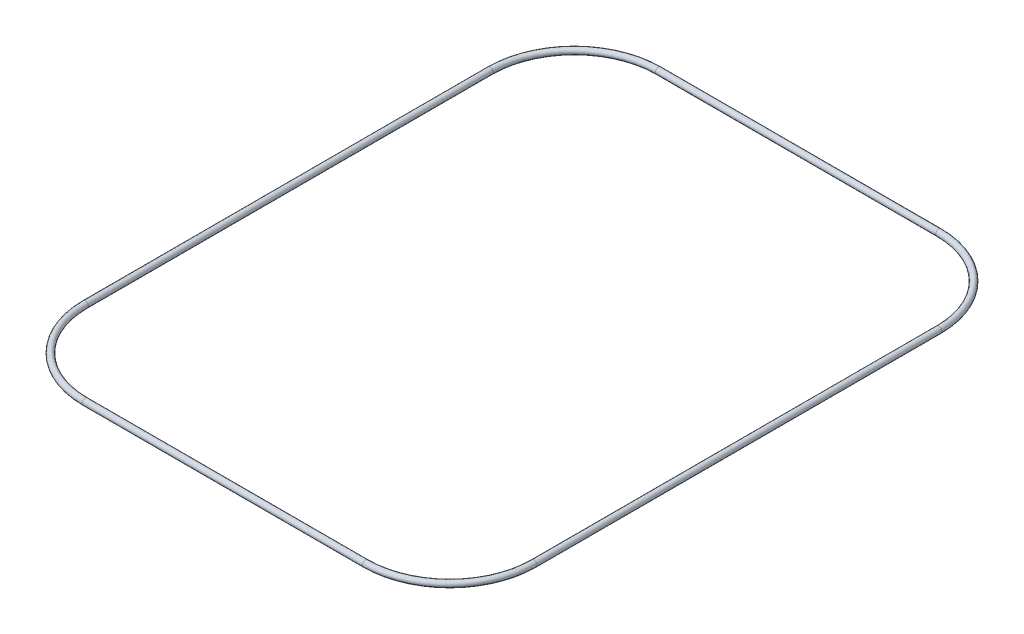
ISO-10303-21;
HEADER;
FILE_DESCRIPTION(('STEP AP214'),'2;1');
FILE_NAME('part.step','',(''),(''),'','','');
FILE_SCHEMA(('AUTOMOTIVE_DESIGN { 1 0 10303 214 1 1 1 1 }'));
ENDSEC;
DATA;
#1=APPLICATION_CONTEXT('core data for automotive mechanical design processes');
#2=APPLICATION_PROTOCOL_DEFINITION('international standard','automotive_design',2000,#1);
#3=PRODUCT_CONTEXT('',#1,'mechanical');
#4=PRODUCT('Part','Part','',(#3));
#5=PRODUCT_RELATED_PRODUCT_CATEGORY('part','',(#4));
#6=PRODUCT_DEFINITION_FORMATION('','',#4);
#7=PRODUCT_DEFINITION_CONTEXT('part definition',#1,'design');
#8=PRODUCT_DEFINITION('design','',#6,#7);
#9=PRODUCT_DEFINITION_SHAPE('','',#8);
#10=(LENGTH_UNIT() NAMED_UNIT(*) SI_UNIT(.MILLI.,.METRE.));
#11=(NAMED_UNIT(*) PLANE_ANGLE_UNIT() SI_UNIT($,.RADIAN.));
#12=(NAMED_UNIT(*) SI_UNIT($,.STERADIAN.) SOLID_ANGLE_UNIT());
#13=UNCERTAINTY_MEASURE_WITH_UNIT(LENGTH_MEASURE(1.E-05),#10,'distance_accuracy_value','');
#14=(GEOMETRIC_REPRESENTATION_CONTEXT(3) GLOBAL_UNCERTAINTY_ASSIGNED_CONTEXT((#13)) GLOBAL_UNIT_ASSIGNED_CONTEXT((#10,
#11,#12)) REPRESENTATION_CONTEXT('',''));
#15=CARTESIAN_POINT('',(0.,0.,0.));
#16=DIRECTION('',(0.,0.,1.));
#17=DIRECTION('',(1.,0.,0.));
#18=AXIS2_PLACEMENT_3D('',#15,#16,#17);
#19=CARTESIAN_POINT('',(66.2758275519008,0.,-71.1102402061064));
#20=DIRECTION('',(0.,0.,1.));
#21=DIRECTION('',(1.,0.,0.));
#22=AXIS2_PLACEMENT_3D('',#19,#20,#21);
#23=CYLINDRICAL_SURFACE('',#22,0.990600000000001);
#24=CARTESIAN_POINT('',(66.2758275519008,0.,58.8897597938936));
#25=DIRECTION('',(0.,0.,-1.));
#26=DIRECTION('',(-1.,0.,0.));
#27=AXIS2_PLACEMENT_3D('',#24,#25,#26);
#28=CIRCLE('',#27,0.990600000000001);
#29=CARTESIAN_POINT('',(67.2664275519008,0.,58.8897597938936));
#30=VERTEX_POINT('',#29);
#31=EDGE_CURVE('E61',#30,#30,#28,.T.);
#32=ORIENTED_EDGE('',*,*,#31,.T.);
#33=EDGE_LOOP('',(#32));
#34=FACE_BOUND('',#33,.T.);
#35=CARTESIAN_POINT('',(66.2758275519008,0.,-71.1102402061064));
#36=DIRECTION('',(0.,0.,-1.));
#37=DIRECTION('',(-1.,0.,0.));
#38=AXIS2_PLACEMENT_3D('',#35,#36,#37);
#39=CIRCLE('',#38,0.990600000000001);
#40=CARTESIAN_POINT('',(67.2664275519008,0.,-71.1102402061064));
#41=VERTEX_POINT('',#40);
#42=EDGE_CURVE('E64',#41,#41,#39,.T.);
#43=ORIENTED_EDGE('',*,*,#42,.F.);
#44=EDGE_LOOP('',(#43));
#45=FACE_BOUND('',#44,.T.);
#46=ADVANCED_FACE('F35',(#34,#45),#23,.T.);
#47=CARTESIAN_POINT('',(39.2356224470694,0.,58.8897597938936));
#48=DIRECTION('',(0.,-1.,0.));
#49=DIRECTION('',(0.,0.,-1.));
#50=AXIS2_PLACEMENT_3D('',#47,#48,#49);
#51=TOROIDAL_SURFACE('',#50,27.0402051048314,0.990600000000001);
#52=CARTESIAN_POINT('',(39.2356224470694,0.,85.9299648987249));
#53=DIRECTION('',(1.,0.,0.));
#54=DIRECTION('',(0.,0.,-1.));
#55=AXIS2_PLACEMENT_3D('',#52,#53,#54);
#56=CIRCLE('',#55,0.990600000000001);
#57=CARTESIAN_POINT('',(39.2356224470694,0.,86.920564898725));
#58=VERTEX_POINT('',#57);
#59=EDGE_CURVE('E58',#58,#58,#56,.T.);
#60=CARTESIAN_POINT('',(39.2356224470694,0.,58.8897597938936));
#61=DIRECTION('',(0.,-1.,0.));
#62=DIRECTION('',(0.,0.,-1.));
#63=AXIS2_PLACEMENT_3D('',#60,#61,#62);
#64=CIRCLE('',#63,28.0308051048314);
#65=EDGE_CURVE('',#30,#58,#64,.T.);
#66=ORIENTED_EDGE('',*,*,#31,.F.);
#67=ORIENTED_EDGE('',*,*,#59,.T.);
#68=ORIENTED_EDGE('',*,*,#65,.T.);
#69=ORIENTED_EDGE('',*,*,#65,.F.);
#70=EDGE_LOOP('',(#66,#68,#67,#69));
#71=FACE_BOUND('',#70,.T.);
#72=ADVANCED_FACE('F71',(#71),#51,.T.);
#73=CARTESIAN_POINT('',(39.2356224470693,0.,85.9299648987249));
#74=DIRECTION('',(-1.,0.,0.));
#75=DIRECTION('',(0.,0.,1.));
#76=AXIS2_PLACEMENT_3D('',#73,#74,#75);
#77=CYLINDRICAL_SURFACE('',#76,0.990600000000001);
#78=CARTESIAN_POINT('',(-50.7643775529306,0.,85.9299648987249));
#79=DIRECTION('',(1.,0.,0.));
#80=DIRECTION('',(0.,0.,-1.));
#81=AXIS2_PLACEMENT_3D('',#78,#79,#80);
#82=CIRCLE('',#81,0.990600000000001);
#83=CARTESIAN_POINT('',(-50.7643775529306,0.,86.920564898725));
#84=VERTEX_POINT('',#83);
#85=EDGE_CURVE('E55',#84,#84,#82,.T.);
#86=ORIENTED_EDGE('',*,*,#85,.T.);
#87=EDGE_LOOP('',(#86));
#88=FACE_BOUND('',#87,.T.);
#89=ORIENTED_EDGE('',*,*,#59,.F.);
#90=EDGE_LOOP('',(#89));
#91=FACE_BOUND('',#90,.T.);
#92=ADVANCED_FACE('F77',(#88,#91),#77,.T.);
#93=CARTESIAN_POINT('',(-50.7643775529306,0.,58.8897597938936));
#94=DIRECTION('',(0.,-1.,0.));
#95=DIRECTION('',(0.,0.,-1.));
#96=AXIS2_PLACEMENT_3D('',#93,#94,#95);
#97=TOROIDAL_SURFACE('',#96,27.0402051048314,0.990600000000001);
#98=CARTESIAN_POINT('',(-77.804582657762,0.,58.8897597938936));
#99=DIRECTION('',(0.,0.,1.));
#100=DIRECTION('',(1.,0.,0.));
#101=AXIS2_PLACEMENT_3D('',#98,#99,#100);
#102=CIRCLE('',#101,0.990600000000001);
#103=CARTESIAN_POINT('',(-78.795182657762,0.,58.8897597938936));
#104=VERTEX_POINT('',#103);
#105=EDGE_CURVE('E50',#104,#104,#102,.T.);
#106=CARTESIAN_POINT('',(-50.7643775529306,0.,58.8897597938936));
#107=DIRECTION('',(0.,-1.,0.));
#108=DIRECTION('',(0.,0.,-1.));
#109=AXIS2_PLACEMENT_3D('',#106,#107,#108);
#110=CIRCLE('',#109,28.0308051048314);
#111=EDGE_CURVE('',#84,#104,#110,.T.);
#112=ORIENTED_EDGE('',*,*,#85,.F.);
#113=ORIENTED_EDGE('',*,*,#105,.T.);
#114=ORIENTED_EDGE('',*,*,#111,.T.);
#115=ORIENTED_EDGE('',*,*,#111,.F.);
#116=EDGE_LOOP('',(#112,#114,#113,#115));
#117=FACE_BOUND('',#116,.T.);
#118=ADVANCED_FACE('F83',(#117),#97,.T.);
#119=CARTESIAN_POINT('',(-77.804582657762,0.,58.8897597938936));
#120=DIRECTION('',(0.,0.,-1.));
#121=DIRECTION('',(-1.,0.,0.));
#122=AXIS2_PLACEMENT_3D('',#119,#120,#121);
#123=CYLINDRICAL_SURFACE('',#122,0.990600000000001);
#124=CARTESIAN_POINT('',(-77.804582657762,0.,-71.1102402061064));
#125=DIRECTION('',(0.,0.,1.));
#126=DIRECTION('',(1.,0.,0.));
#127=AXIS2_PLACEMENT_3D('',#124,#125,#126);
#128=CIRCLE('',#127,0.990600000000001);
#129=CARTESIAN_POINT('',(-78.795182657762,0.,-71.1102402061064));
#130=VERTEX_POINT('',#129);
#131=EDGE_CURVE('E46',#130,#130,#128,.T.);
#132=ORIENTED_EDGE('',*,*,#131,.T.);
#133=EDGE_LOOP('',(#132));
#134=FACE_BOUND('',#133,.T.);
#135=ORIENTED_EDGE('',*,*,#105,.F.);
#136=EDGE_LOOP('',(#135));
#137=FACE_BOUND('',#136,.T.);
#138=ADVANCED_FACE('F87',(#134,#137),#123,.T.);
#139=CARTESIAN_POINT('',(-50.7643775529306,0.,-71.1102402061064));
#140=DIRECTION('',(0.,-1.,0.));
#141=DIRECTION('',(0.,0.,-1.));
#142=AXIS2_PLACEMENT_3D('',#139,#140,#141);
#143=TOROIDAL_SURFACE('',#142,27.0402051048314,0.990600000000001);
#144=CARTESIAN_POINT('',(-50.7643775529306,0.,-98.1504453109378));
#145=DIRECTION('',(-1.,0.,0.));
#146=DIRECTION('',(0.,0.,1.));
#147=AXIS2_PLACEMENT_3D('',#144,#145,#146);
#148=CIRCLE('',#147,0.990600000000001);
#149=CARTESIAN_POINT('',(-50.7643775529306,0.,-99.1410453109378));
#150=VERTEX_POINT('',#149);
#151=EDGE_CURVE('E42',#150,#150,#148,.T.);
#152=CARTESIAN_POINT('',(-50.7643775529306,0.,-71.1102402061064));
#153=DIRECTION('',(0.,-1.,0.));
#154=DIRECTION('',(0.,0.,-1.));
#155=AXIS2_PLACEMENT_3D('',#152,#153,#154);
#156=CIRCLE('',#155,28.0308051048314);
#157=EDGE_CURVE('',#130,#150,#156,.T.);
#158=ORIENTED_EDGE('',*,*,#131,.F.);
#159=ORIENTED_EDGE('',*,*,#151,.T.);
#160=ORIENTED_EDGE('',*,*,#157,.T.);
#161=ORIENTED_EDGE('',*,*,#157,.F.);
#162=EDGE_LOOP('',(#158,#160,#159,#161));
#163=FACE_BOUND('',#162,.T.);
#164=ADVANCED_FACE('F91',(#163),#143,.T.);
#165=CARTESIAN_POINT('',(-50.7643775529305,0.,-98.1504453109378));
#166=DIRECTION('',(1.,0.,0.));
#167=DIRECTION('',(0.,0.,-1.));
#168=AXIS2_PLACEMENT_3D('',#165,#166,#167);
#169=CYLINDRICAL_SURFACE('',#168,0.990600000000001);
#170=CARTESIAN_POINT('',(39.2356224470694,0.,-98.1504453109378));
#171=DIRECTION('',(-1.,0.,0.));
#172=DIRECTION('',(0.,0.,1.));
#173=AXIS2_PLACEMENT_3D('',#170,#171,#172);
#174=CIRCLE('',#173,0.990600000000001);
#175=CARTESIAN_POINT('',(39.2356224470694,0.,-99.1410453109378));
#176=VERTEX_POINT('',#175);
#177=EDGE_CURVE('E10',#176,#176,#174,.T.);
#178=ORIENTED_EDGE('',*,*,#177,.T.);
#179=EDGE_LOOP('',(#178));
#180=FACE_BOUND('',#179,.T.);
#181=ORIENTED_EDGE('',*,*,#151,.F.);
#182=EDGE_LOOP('',(#181));
#183=FACE_BOUND('',#182,.T.);
#184=ADVANCED_FACE('F94',(#180,#183),#169,.T.);
#185=CARTESIAN_POINT('',(39.2356224470694,0.,-71.1102402061064));
#186=DIRECTION('',(0.,-1.,0.));
#187=DIRECTION('',(0.,0.,-1.));
#188=AXIS2_PLACEMENT_3D('',#185,#186,#187);
#189=TOROIDAL_SURFACE('',#188,27.0402051048314,0.990600000000001);
#190=CARTESIAN_POINT('',(39.2356224470694,0.,-71.1102402061064));
#191=DIRECTION('',(0.,-1.,0.));
#192=DIRECTION('',(0.,0.,-1.));
#193=AXIS2_PLACEMENT_3D('',#190,#191,#192);
#194=CIRCLE('',#193,28.0308051048314);
#195=EDGE_CURVE('',#176,#41,#194,.T.);
#196=ORIENTED_EDGE('',*,*,#177,.F.);
#197=ORIENTED_EDGE('',*,*,#42,.T.);
#198=ORIENTED_EDGE('',*,*,#195,.T.);
#199=ORIENTED_EDGE('',*,*,#195,.F.);
#200=EDGE_LOOP('',(#196,#198,#197,#199));
#201=FACE_BOUND('',#200,.T.);
#202=ADVANCED_FACE('F37',(#201),#189,.T.);
#203=CLOSED_SHELL('',(#46,#72,#92,#118,#138,#164,#184,#202));
#204=MANIFOLD_SOLID_BREP('B2',#203);
#205=ADVANCED_BREP_SHAPE_REPRESENTATION('',(#18,#204),#14);
#206=SHAPE_DEFINITION_REPRESENTATION(#9,#205);
ENDSEC;
END-ISO-10303-21;
